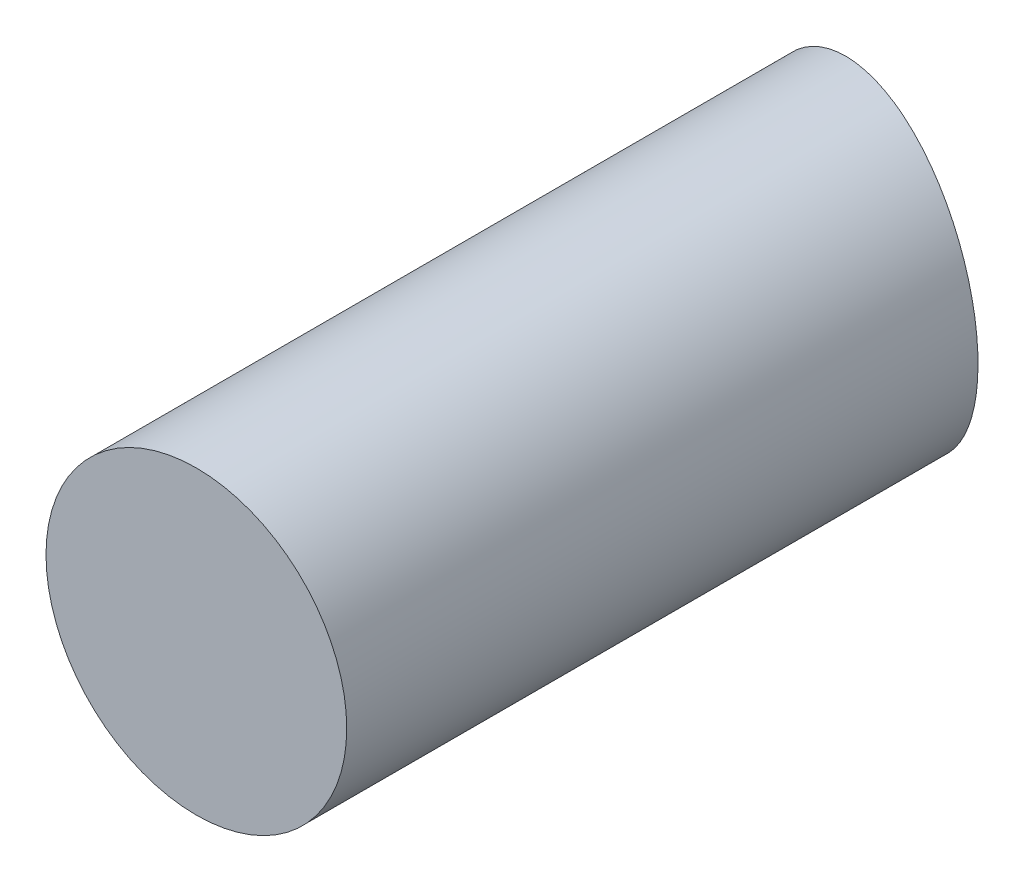
ISO-10303-21;
HEADER;
FILE_DESCRIPTION(('STEP AP214'),'2;1');
FILE_NAME('part.step','',(''),(''),'','','');
FILE_SCHEMA(('AUTOMOTIVE_DESIGN { 1 0 10303 214 1 1 1 1 }'));
ENDSEC;
DATA;
#1=APPLICATION_CONTEXT('core data for automotive mechanical design processes');
#2=APPLICATION_PROTOCOL_DEFINITION('international standard','automotive_design',2000,#1);
#3=PRODUCT_CONTEXT('',#1,'mechanical');
#4=PRODUCT('Part','Part','',(#3));
#5=PRODUCT_RELATED_PRODUCT_CATEGORY('part','',(#4));
#6=PRODUCT_DEFINITION_FORMATION('','',#4);
#7=PRODUCT_DEFINITION_CONTEXT('part definition',#1,'design');
#8=PRODUCT_DEFINITION('design','',#6,#7);
#9=PRODUCT_DEFINITION_SHAPE('','',#8);
#10=(LENGTH_UNIT() NAMED_UNIT(*) SI_UNIT(.MILLI.,.METRE.));
#11=(NAMED_UNIT(*) PLANE_ANGLE_UNIT() SI_UNIT($,.RADIAN.));
#12=(NAMED_UNIT(*) SI_UNIT($,.STERADIAN.) SOLID_ANGLE_UNIT());
#13=UNCERTAINTY_MEASURE_WITH_UNIT(LENGTH_MEASURE(1.E-05),#10,'distance_accuracy_value','');
#14=(GEOMETRIC_REPRESENTATION_CONTEXT(3) GLOBAL_UNCERTAINTY_ASSIGNED_CONTEXT((#13)) GLOBAL_UNIT_ASSIGNED_CONTEXT((#10,
#11,#12)) REPRESENTATION_CONTEXT('',''));
#15=CARTESIAN_POINT('',(0.,0.,0.));
#16=DIRECTION('',(0.,0.,1.));
#17=DIRECTION('',(1.,0.,0.));
#18=AXIS2_PLACEMENT_3D('',#15,#16,#17);
#19=CARTESIAN_POINT('',(0.,0.,25.4));
#20=DIRECTION('',(0.,0.,-1.));
#21=DIRECTION('',(-1.,0.,0.));
#22=AXIS2_PLACEMENT_3D('',#19,#20,#21);
#23=CYLINDRICAL_SURFACE('',#22,4.7625);
#24=CARTESIAN_POINT('',(-4.7625,0.,2.85320128294335));
#25=CARTESIAN_POINT('',(-4.76250106298141,-0.131587360555371,2.85320113330402));
#26=CARTESIAN_POINT('',(-4.75704376962075,-0.263158536957747,2.85434026069952));
#27=CARTESIAN_POINT('',(-4.73525828985299,-0.525401296194087,2.85889274519464));
#28=CARTESIAN_POINT('',(-4.71892725876148,-0.656072634580553,2.86230669741258));
#29=CARTESIAN_POINT('',(-4.67550276825158,-0.915649186821758,2.87140083091772));
#30=CARTESIAN_POINT('',(-4.64839994047974,-1.04455276201086,2.87708298490454));
#31=CARTESIAN_POINT('',(-4.58363812911504,-1.29960979282375,2.89069488333815));
#32=CARTESIAN_POINT('',(-4.54597525829843,-1.42576221726496,2.898625455455));
#33=CARTESIAN_POINT('',(-4.46045065822028,-1.67422443352905,2.91669313611326));
#34=CARTESIAN_POINT('',(-4.41260141766563,-1.79653872217786,2.92682754303024));
#35=CARTESIAN_POINT('',(-4.30703584122849,-2.0366780830198,2.94927588202704));
#36=CARTESIAN_POINT('',(-4.24931587963639,-2.15450148610537,2.96159061504234));
#37=CARTESIAN_POINT('',(-4.12451118418735,-2.38473251439018,2.988344784109));
#38=CARTESIAN_POINT('',(-4.0574321261466,-2.49714336686153,3.00278293270166));
#39=CARTESIAN_POINT('',(-3.91437560410311,-2.71590818808011,3.0337439178765));
#40=CARTESIAN_POINT('',(-3.83839483604331,-2.82225988593674,3.05026752869885));
#41=CARTESIAN_POINT('',(-3.6775286526888,-3.02893828919943,3.08546975576363));
#42=CARTESIAN_POINT('',(-3.59258020347784,-3.12921331082075,3.10416373355283));
#43=CARTESIAN_POINT('',(-3.41487684259789,-3.32223387178582,3.14354480155088));
#44=CARTESIAN_POINT('',(-3.32211908181737,-3.41497663864168,3.16423261958474));
#45=CARTESIAN_POINT('',(-3.12954909137744,-3.59227694492099,3.20751483383484));
#46=CARTESIAN_POINT('',(-3.02973883638615,-3.67683675994637,3.23010869670759));
#47=CARTESIAN_POINT('',(-2.8237411814404,-3.83730967752075,3.27713337611358));
#48=CARTESIAN_POINT('',(-2.71755141214413,-3.91321953678898,3.30156487600195));
#49=CARTESIAN_POINT('',(-2.49748591269027,-4.0572896718737,3.35265519927787));
#50=CARTESIAN_POINT('',(-2.38350115638012,-4.12527138355891,3.37934799613));
#51=CARTESIAN_POINT('',(-2.15053984204762,-4.25136858886616,3.43443827499811));
#52=CARTESIAN_POINT('',(-2.03156145828016,-4.30948043403073,3.46283638216482));
#53=CARTESIAN_POINT('',(-1.78954316388683,-4.41547139784238,3.52119695723151));
#54=CARTESIAN_POINT('',(-1.66650437148258,-4.46335330707083,3.5511589957311));
#55=CARTESIAN_POINT('',(-1.41715904075307,-4.54867448721692,3.61252549624933));
#56=CARTESIAN_POINT('',(-1.29085129498402,-4.58610983758509,3.64393049466886));
#57=CARTESIAN_POINT('',(-1.03261725685539,-4.65115868074214,3.70883664933526));
#58=CARTESIAN_POINT('',(-0.900629812158896,-4.67849753105908,3.74237082987269));
#59=CARTESIAN_POINT('',(-0.635091530613129,-4.72188464085857,3.81059354202817));
#60=CARTESIAN_POINT('',(-0.50154013154302,-4.73792870491906,3.84528249757937));
#61=CARTESIAN_POINT('',(-0.0999896231957147,-4.76899757200187,3.95075574713836));
#62=CARTESIAN_POINT('',(0.169139191152021,-4.76701735291122,4.02300497788295));
#63=CARTESIAN_POINT('',(0.709473910111085,-4.71737594608457,4.17117581785146));
#64=CARTESIAN_POINT('',(0.980556021111849,-4.66854432461839,4.24714408917414));
#65=CARTESIAN_POINT('',(1.51049776665746,-4.52494663472784,4.39854730920885));
#66=CARTESIAN_POINT('',(1.76935590586444,-4.43017496242626,4.47398219171758));
#67=CARTESIAN_POINT('',(2.2703839748888,-4.19572417072577,4.62237761833133));
#68=CARTESIAN_POINT('',(2.51234078476245,-4.05556593098119,4.69530214422409));
#69=CARTESIAN_POINT('',(2.96923773154092,-3.73403752321734,4.83482301695333));
#70=CARTESIAN_POINT('',(3.18417977083787,-3.55267025968416,4.90141980931094));
#71=CARTESIAN_POINT('',(3.57618148603397,-3.15726056300167,5.02408533692254));
#72=CARTESIAN_POINT('',(3.75390632341846,-2.94393532849219,5.08033624622952));
#73=CARTESIAN_POINT('',(4.07055781749837,-2.48776660950309,5.18125369808104));
#74=CARTESIAN_POINT('',(4.20949562334084,-2.24493163632286,5.22592356927584));
#75=CARTESIAN_POINT('',(4.43801937119961,-1.74834597329114,5.29971857184602));
#76=CARTESIAN_POINT('',(4.529545461919,-1.49557882206842,5.32945296766194));
#77=CARTESIAN_POINT('',(4.66891097494206,-0.97707647351347,5.37482383150169));
#78=CARTESIAN_POINT('',(4.71676290141356,-0.711345010906784,5.39046433467286));
#79=CARTESIAN_POINT('',(4.76584248855966,-0.186398685459699,5.40650811080488));
#80=CARTESIAN_POINT('',(4.76893353326943,0.0726249743680484,5.40752035086424));
#81=CARTESIAN_POINT('',(4.7331693857141,0.58742435764871,5.39582639334637));
#82=CARTESIAN_POINT('',(4.6943185950012,0.843200419068419,5.38312163528848));
#83=CARTESIAN_POINT('',(4.57684468833747,1.34109939006193,5.34483776589658));
#84=CARTESIAN_POINT('',(4.49871066002587,1.58335044879856,5.319416991875));
#85=CARTESIAN_POINT('',(4.30563892142604,2.05107570272194,5.2569267899228));
#86=CARTESIAN_POINT('',(4.19069814867195,2.27654849996687,5.21985639270251));
#87=CARTESIAN_POINT('',(3.92463609003552,2.71013470466486,5.13465554748311));
#88=CARTESIAN_POINT('',(3.77273595186802,2.91772281555725,5.08628805635025));
#89=CARTESIAN_POINT('',(3.43891020033363,3.30463885772818,4.98099479779695));
#90=CARTESIAN_POINT('',(3.25697838867991,3.48396094016704,4.9240672638716));
#91=CARTESIAN_POINT('',(2.85944993643816,3.81775495527264,4.80113933310688));
#92=CARTESIAN_POINT('',(2.64271478328498,3.97076432215713,4.73484776456486));
#93=CARTESIAN_POINT('',(2.18800711044438,4.23836175931447,4.59783766761333));
#94=CARTESIAN_POINT('',(1.95002978744376,4.35294111172347,4.52711813903123));
#95=CARTESIAN_POINT('',(1.44876575944585,4.5450316610509,4.38075564875063));
#96=CARTESIAN_POINT('',(1.18484245891787,4.62083880279798,4.30502955074261));
#97=CARTESIAN_POINT('',(0.782305368055239,4.69980819733971,4.19187954705274));
#98=CARTESIAN_POINT('',(0.646937250399178,4.72034291978256,4.15421436498496));
#99=CARTESIAN_POINT('',(0.374835297300949,4.74969434957579,4.07930519085613));
#100=CARTESIAN_POINT('',(0.238101984870268,4.75851538310615,4.04206104833546));
#101=CARTESIAN_POINT('',(-0.0378501189536562,4.76437958993374,3.9677171913244));
#102=CARTESIAN_POINT('',(-0.177075441809722,4.76124421700752,3.93062801203998));
#103=CARTESIAN_POINT('',(-0.454924048800617,4.74276554988207,3.85744402518438));
#104=CARTESIAN_POINT('',(-0.593547539779683,4.72742685025258,3.82134884866046));
#105=CARTESIAN_POINT('',(-0.869268716161384,4.68457578498859,3.75036565680721));
#106=CARTESIAN_POINT('',(-1.00636583894358,4.65705907351046,3.71547807721716));
#107=CARTESIAN_POINT('',(-1.27789085258659,4.58998350080664,3.64715106974148));
#108=CARTESIAN_POINT('',(-1.41231980706255,4.55042954504751,3.6137110582662));
#109=CARTESIAN_POINT('',(-1.67568548995807,4.46011161685502,3.54890490149739));
#110=CARTESIAN_POINT('',(-1.80467244201966,4.40951009356839,3.51751648475794));
#111=CARTESIAN_POINT('',(-2.0580357938906,4.29710291540433,3.45649027692838));
#112=CARTESIAN_POINT('',(-2.18241405262941,4.23530183847832,3.42685177707765));
#113=CARTESIAN_POINT('',(-2.425656699029,4.10084289091252,3.36944566485194));
#114=CARTESIAN_POINT('',(-2.54451963089762,4.0281821749516,3.34167854556991));
#115=CARTESIAN_POINT('',(-2.77568060218114,3.87251997638195,3.28815988341085));
#116=CARTESIAN_POINT('',(-2.88798135471389,3.78952281243779,3.2624075060296));
#117=CARTESIAN_POINT('',(-3.10224358257776,3.61607263754898,3.21367454314781));
#118=CARTESIAN_POINT('',(-3.20440065706171,3.52587676982949,3.19063843844797));
#119=CARTESIAN_POINT('',(-3.40079663643773,3.33684817860172,3.14666949347718));
#120=CARTESIAN_POINT('',(-3.49503880820124,3.23801905317106,3.12573578473792));
#121=CARTESIAN_POINT('',(-3.67492763114444,3.0323243396739,3.08603200282242));
#122=CARTESIAN_POINT('',(-3.76056963291771,2.9254544586581,3.06726309917278));
#123=CARTESIAN_POINT('',(-3.92245449316094,2.70453357700918,3.03198180587791));
#124=CARTESIAN_POINT('',(-3.99870115448492,2.59048551024231,3.01546850296108));
#125=CARTESIAN_POINT('',(-4.13944053181242,2.35888679344531,2.98513108544265));
#126=CARTESIAN_POINT('',(-4.2041758307626,2.24149084348506,2.97125090911966));
#127=CARTESIAN_POINT('',(-4.32357780249631,2.00150844633142,2.94574702472144));
#128=CARTESIAN_POINT('',(-4.3782485113207,1.87892410411691,2.93412241203238));
#129=CARTESIAN_POINT('',(-4.47705406453296,1.62952873310082,2.91317701089507));
#130=CARTESIAN_POINT('',(-4.52119929963639,1.50272201477576,2.90385395003729));
#131=CARTESIAN_POINT('',(-4.59864621715546,1.24573987306476,2.88753474813682));
#132=CARTESIAN_POINT('',(-4.63195093628813,1.11556540412433,2.88053795543269));
#133=CARTESIAN_POINT('',(-4.69382083746701,0.822616533180718,2.86755912033006));
#134=CARTESIAN_POINT('',(-4.71955024271118,0.659208486297784,2.86217719549706));
#135=CARTESIAN_POINT('',(-4.75388907026515,0.330525105824516,2.85499838882638));
#136=CARTESIAN_POINT('',(-4.76249866508869,0.165249791067235,2.85320147086312));
#137=CARTESIAN_POINT('',(-4.7625,0.,2.85320128294335));
#138=B_SPLINE_CURVE_WITH_KNOTS('',3,(#24,#25,#26,#27,#28,#29,#30,#31,#32,#33,#34,#35,#36,#37,
#38,#39,#40,#41,#42,#43,#44,#45,#46,#47,#48,#49,#50,#51,#52,#53,#54,#55,#56,#57,#58,#59,#60,#61,
#62,#63,#64,#65,#66,#67,#68,#69,#70,#71,#72,#73,#74,#75,#76,#77,#78,#79,#80,#81,#82,#83,#84,#85,
#86,#87,#88,#89,#90,#91,#92,#93,#94,#95,#96,#97,#98,#99,#100,#101,#102,#103,#104,#105,#106,#107,
#108,#109,#110,#111,#112,#113,#114,#115,#116,#117,#118,#119,#120,#121,#122,#123,#124,#125,#126,
#127,#128,#129,#130,#131,#132,#133,#134,#135,#136,#137),.UNSPECIFIED.,.T.,.F.,(4,2,2,2,2,2,2,2,
2,2,2,2,2,2,2,2,2,2,2,2,2,2,2,2,2,2,2,2,2,2,2,2,2,2,2,2,2,2,2,2,2,2,2,2,2,2,2,2,2,2,2,2,2,2,2,2,
4),(0.,0.394616305297224,0.789335886962999,1.18439951457773,1.57960875916114,1.97433623089087,
2.36920900643154,2.76384334425118,3.15862462576046,3.55639337354548,3.95430787550738,
4.35211140126715,4.75006359512949,5.15572313857838,5.56153231175894,5.96723064421498,
6.3730810294027,6.78927515951551,7.20562380251571,8.03758726078501,8.8908909416207,
9.74429873668226,10.6070263864345,11.4696932484428,12.3152982022866,13.1606598401626,
13.9679649722574,14.7750388956145,15.5484131312209,16.3217062135786,17.0856015318219,
17.8495604256809,18.6312761122919,19.4131533406887,20.2298553594667,21.0467425223071,
21.8969752417642,22.3225852906107,22.7480381064745,23.1798689550692,23.6115372956365,
24.043359805677,24.4750065727789,24.9006889564993,25.3261977283395,25.7518181833092,
26.1772614029331,26.5913845280581,27.0053358753478,27.4195098208215,27.8335155708885,
28.2373586353015,28.6410393985622,29.0443199839179,29.4474875022303,29.9430588006492,
30.4386251052461),.UNSPECIFIED.);
#139=CARTESIAN_POINT('',(-4.7625,0.,2.85320128294335));
#140=VERTEX_POINT('',#139);
#141=EDGE_CURVE('E71',#140,#140,#138,.T.);
#142=ORIENTED_EDGE('',*,*,#141,.T.);
#143=EDGE_LOOP('',(#142));
#144=FACE_BOUND('',#143,.T.);
#145=CARTESIAN_POINT('',(0.,0.,25.4));
#146=DIRECTION('',(0.,0.,1.));
#147=DIRECTION('',(1.,0.,0.));
#148=AXIS2_PLACEMENT_3D('',#145,#146,#147);
#149=CIRCLE('',#148,4.7625);
#150=CARTESIAN_POINT('',(4.7625,0.,25.4));
#151=VERTEX_POINT('',#150);
#152=EDGE_CURVE('E11',#151,#151,#149,.T.);
#153=ORIENTED_EDGE('',*,*,#152,.F.);
#154=EDGE_LOOP('',(#153));
#155=FACE_BOUND('',#154,.T.);
#156=ADVANCED_FACE('F67',(#144,#155),#23,.T.);
#157=CARTESIAN_POINT('',(0.,0.,25.4));
#158=DIRECTION('',(0.,0.,1.));
#159=DIRECTION('',(1.,0.,0.));
#160=AXIS2_PLACEMENT_3D('',#157,#158,#159);
#161=PLANE('',#160);
#162=ORIENTED_EDGE('',*,*,#152,.T.);
#163=EDGE_LOOP('',(#162));
#164=FACE_BOUND('',#163,.T.);
#165=ADVANCED_FACE('F89',(#164),#161,.T.);
#166=CARTESIAN_POINT('',(10.0332417953837,0.,5.72932382605083));
#167=DIRECTION('',(-0.965925826289069,0.,-0.258819045102518));
#168=DIRECTION('',(0.,1.,0.));
#169=AXIS2_PLACEMENT_3D('',#166,#167,#168);
#170=ELLIPSE('',#169,9.36282746846473,1.05129871910492);
#171=DIRECTION('',(-0.965925826289069,0.,-0.258819045102518));
#172=VECTOR('',#171,1.);
#173=SURFACE_OF_LINEAR_EXTRUSION('',#170,#172);
#174=ORIENTED_EDGE('',*,*,#141,.F.);
#175=EDGE_LOOP('',(#174));
#176=FACE_BOUND('',#175,.T.);
#177=ADVANCED_FACE('F86',(#176),#173,.F.);
#178=CLOSED_SHELL('',(#156,#165,#177));
#179=MANIFOLD_SOLID_BREP('B2',#178);
#180=ADVANCED_BREP_SHAPE_REPRESENTATION('',(#18,#179),#14);
#181=SHAPE_DEFINITION_REPRESENTATION(#9,#180);
ENDSEC;
END-ISO-10303-21;
